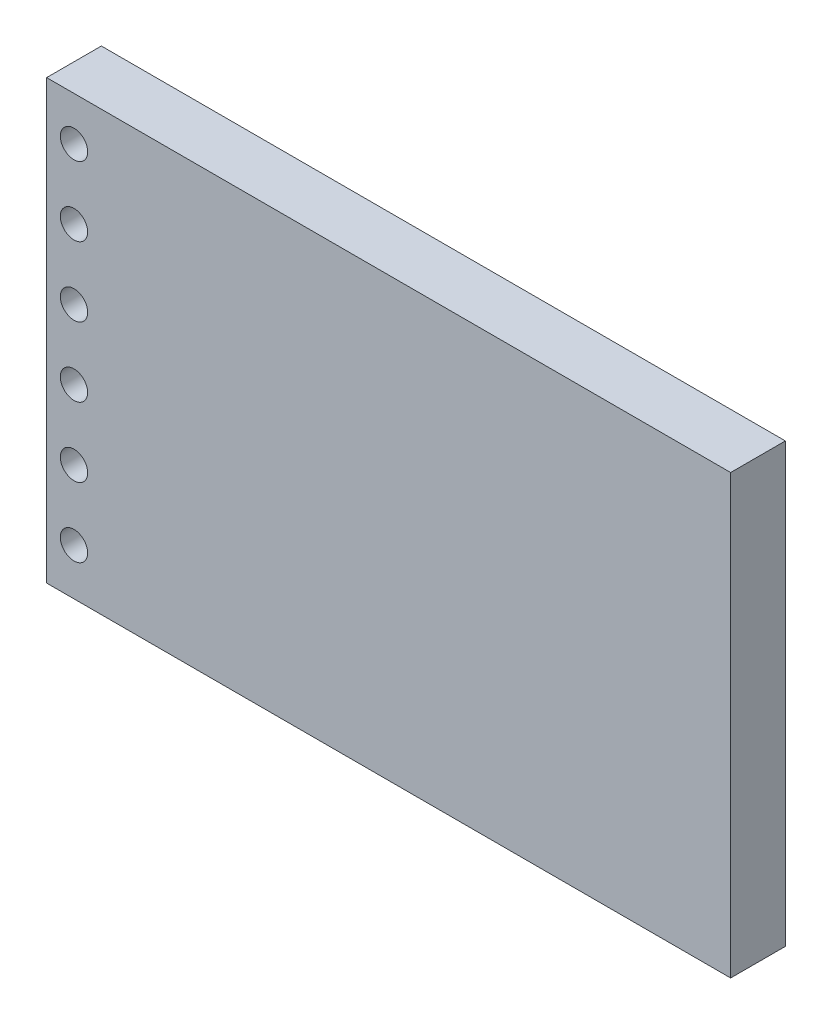
ISO-10303-21;
HEADER;
FILE_DESCRIPTION(('STEP AP214'),'2;1');
FILE_NAME('part.step','',(''),(''),'','','');
FILE_SCHEMA(('AUTOMOTIVE_DESIGN { 1 0 10303 214 1 1 1 1 }'));
ENDSEC;
DATA;
#1=APPLICATION_CONTEXT('core data for automotive mechanical design processes');
#2=APPLICATION_PROTOCOL_DEFINITION('international standard','automotive_design',2000,#1);
#3=PRODUCT_CONTEXT('',#1,'mechanical');
#4=PRODUCT('Part','Part','',(#3));
#5=PRODUCT_RELATED_PRODUCT_CATEGORY('part','',(#4));
#6=PRODUCT_DEFINITION_FORMATION('','',#4);
#7=PRODUCT_DEFINITION_CONTEXT('part definition',#1,'design');
#8=PRODUCT_DEFINITION('design','',#6,#7);
#9=PRODUCT_DEFINITION_SHAPE('','',#8);
#10=(LENGTH_UNIT() NAMED_UNIT(*) SI_UNIT(.MILLI.,.METRE.));
#11=(NAMED_UNIT(*) PLANE_ANGLE_UNIT() SI_UNIT($,.RADIAN.));
#12=(NAMED_UNIT(*) SI_UNIT($,.STERADIAN.) SOLID_ANGLE_UNIT());
#13=UNCERTAINTY_MEASURE_WITH_UNIT(LENGTH_MEASURE(1.E-05),#10,'distance_accuracy_value','');
#14=(GEOMETRIC_REPRESENTATION_CONTEXT(3) GLOBAL_UNCERTAINTY_ASSIGNED_CONTEXT((#13)) GLOBAL_UNIT_ASSIGNED_CONTEXT((#10,
#11,#12)) REPRESENTATION_CONTEXT('',''));
#15=CARTESIAN_POINT('',(0.,0.,0.));
#16=DIRECTION('',(0.,0.,1.));
#17=DIRECTION('',(1.,0.,0.));
#18=AXIS2_PLACEMENT_3D('',#15,#16,#17);
#19=CARTESIAN_POINT('',(0.,0.,2.));
#20=DIRECTION('',(0.,1.,0.));
#21=DIRECTION('',(0.,0.,1.));
#22=AXIS2_PLACEMENT_3D('',#19,#20,#21);
#23=PLANE('',#22);
#24=DIRECTION('',(1.,0.,0.));
#25=VECTOR('',#24,1.);
#26=CARTESIAN_POINT('',(0.,0.,0.));
#27=LINE('',#26,#25);
#28=CARTESIAN_POINT('',(0.,0.,0.));
#29=VERTEX_POINT('',#28);
#30=CARTESIAN_POINT('',(18.,0.,0.));
#31=VERTEX_POINT('',#30);
#32=EDGE_CURVE('E446',#29,#31,#27,.T.);
#33=ORIENTED_EDGE('',*,*,#32,.T.);
#34=DIRECTION('',(0.,0.,1.));
#35=VECTOR('',#34,1.);
#36=CARTESIAN_POINT('',(18.,0.,-2.));
#37=LINE('',#36,#35);
#38=CARTESIAN_POINT('',(18.,0.,-2.));
#39=VERTEX_POINT('',#38);
#40=EDGE_CURVE('E274',#39,#31,#37,.T.);
#41=ORIENTED_EDGE('',*,*,#40,.F.);
#42=DIRECTION('',(-1.,0.,0.));
#43=VECTOR('',#42,1.);
#44=CARTESIAN_POINT('',(22.,0.,-2.));
#45=LINE('',#44,#43);
#46=CARTESIAN_POINT('',(22.,0.,-2.));
#47=VERTEX_POINT('',#46);
#48=EDGE_CURVE('E259',#47,#39,#45,.T.);
#49=ORIENTED_EDGE('',*,*,#48,.F.);
#50=DIRECTION('',(0.,0.,1.));
#51=VECTOR('',#50,1.);
#52=CARTESIAN_POINT('',(22.,0.,-2.));
#53=LINE('',#52,#51);
#54=CARTESIAN_POINT('',(22.,0.,0.));
#55=VERTEX_POINT('',#54);
#56=EDGE_CURVE('E276',#47,#55,#53,.T.);
#57=ORIENTED_EDGE('',*,*,#56,.T.);
#58=CARTESIAN_POINT('',(25.,0.,0.));
#59=VERTEX_POINT('',#58);
#60=EDGE_CURVE('E445',#55,#59,#27,.T.);
#61=ORIENTED_EDGE('',*,*,#60,.T.);
#62=DIRECTION('',(0.,0.,-1.));
#63=VECTOR('',#62,1.);
#64=CARTESIAN_POINT('',(25.,0.,2.));
#65=LINE('',#64,#63);
#66=CARTESIAN_POINT('',(25.,0.,2.));
#67=VERTEX_POINT('',#66);
#68=EDGE_CURVE('E50',#67,#59,#65,.T.);
#69=ORIENTED_EDGE('',*,*,#68,.F.);
#70=DIRECTION('',(1.,0.,0.));
#71=VECTOR('',#70,1.);
#72=CARTESIAN_POINT('',(0.,0.,2.));
#73=LINE('',#72,#71);
#74=CARTESIAN_POINT('',(0.,0.,2.));
#75=VERTEX_POINT('',#74);
#76=EDGE_CURVE('E435',#75,#67,#73,.T.);
#77=ORIENTED_EDGE('',*,*,#76,.F.);
#78=DIRECTION('',(0.,0.,-1.));
#79=VECTOR('',#78,1.);
#80=CARTESIAN_POINT('',(0.,0.,2.));
#81=LINE('',#80,#79);
#82=EDGE_CURVE('E11',#75,#29,#81,.T.);
#83=ORIENTED_EDGE('',*,*,#82,.T.);
#84=EDGE_LOOP('',(#33,#41,#49,#57,#61,#69,#77,#83));
#85=FACE_BOUND('',#84,.T.);
#86=DIRECTION('',(0.,0.,-1.));
#87=VECTOR('',#86,1.);
#88=CARTESIAN_POINT('',(19.114135809883,0.,-0.309527281272606));
#89=LINE('',#88,#87);
#90=CARTESIAN_POINT('',(19.114135809883,0.,-0.309527281272606));
#91=VERTEX_POINT('',#90);
#92=CARTESIAN_POINT('',(19.114135809883,0.,-1.36845032168736));
#93=VERTEX_POINT('',#92);
#94=EDGE_CURVE('E247',#91,#93,#89,.T.);
#95=ORIENTED_EDGE('',*,*,#94,.F.);
#96=DIRECTION('',(-1.,0.,0.));
#97=VECTOR('',#96,1.);
#98=CARTESIAN_POINT('',(19.114135809883,0.,-0.309527281272606));
#99=LINE('',#98,#97);
#100=CARTESIAN_POINT('',(20.8827625901502,0.,-0.309527281272606));
#101=VERTEX_POINT('',#100);
#102=EDGE_CURVE('E244',#101,#91,#99,.T.);
#103=ORIENTED_EDGE('',*,*,#102,.F.);
#104=DIRECTION('',(0.,0.,1.));
#105=VECTOR('',#104,1.);
#106=CARTESIAN_POINT('',(20.8827625901502,0.,-0.309527281272606));
#107=LINE('',#106,#105);
#108=CARTESIAN_POINT('',(20.8827625901502,0.,-1.36845032168736));
#109=VERTEX_POINT('',#108);
#110=EDGE_CURVE('E62',#109,#101,#107,.T.);
#111=ORIENTED_EDGE('',*,*,#110,.F.);
#112=DIRECTION('',(1.,0.,0.));
#113=VECTOR('',#112,1.);
#114=CARTESIAN_POINT('',(19.114135809883,0.,-1.36845032168736));
#115=LINE('',#114,#113);
#116=EDGE_CURVE('E57',#93,#109,#115,.T.);
#117=ORIENTED_EDGE('',*,*,#116,.F.);
#118=EDGE_LOOP('',(#95,#103,#111,#117));
#119=FACE_BOUND('',#118,.T.);
#120=ADVANCED_FACE('F42',(#85,#119),#23,.F.);
#121=CARTESIAN_POINT('',(0.,0.,0.));
#122=DIRECTION('',(0.,0.,-1.));
#123=DIRECTION('',(-1.,0.,0.));
#124=AXIS2_PLACEMENT_3D('',#121,#122,#123);
#125=PLANE('',#124);
#126=CARTESIAN_POINT('',(1.,14.4,0.));
#127=DIRECTION('',(0.,0.,-1.));
#128=DIRECTION('',(-1.,0.,0.));
#129=AXIS2_PLACEMENT_3D('',#126,#127,#128);
#130=CIRCLE('',#129,0.500000000000001);
#131=CARTESIAN_POINT('',(0.499999999999999,14.4,0.));
#132=VERTEX_POINT('',#131);
#133=EDGE_CURVE('E400',#132,#132,#130,.T.);
#134=ORIENTED_EDGE('',*,*,#133,.F.);
#135=EDGE_LOOP('',(#134));
#136=FACE_BOUND('',#135,.T.);
#137=CARTESIAN_POINT('',(0.999999999999974,11.86,0.));
#138=DIRECTION('',(0.,0.,-1.));
#139=DIRECTION('',(-1.,0.,0.));
#140=AXIS2_PLACEMENT_3D('',#137,#138,#139);
#141=CIRCLE('',#140,0.500000000000001);
#142=CARTESIAN_POINT('',(0.499999999999973,11.86,0.));
#143=VERTEX_POINT('',#142);
#144=EDGE_CURVE('E403',#143,#143,#141,.T.);
#145=ORIENTED_EDGE('',*,*,#144,.F.);
#146=EDGE_LOOP('',(#145));
#147=FACE_BOUND('',#146,.T.);
#148=CARTESIAN_POINT('',(0.999999999999947,9.32,0.));
#149=DIRECTION('',(0.,0.,-1.));
#150=DIRECTION('',(-1.,0.,0.));
#151=AXIS2_PLACEMENT_3D('',#148,#149,#150);
#152=CIRCLE('',#151,0.500000000000001);
#153=CARTESIAN_POINT('',(0.499999999999947,9.32,0.));
#154=VERTEX_POINT('',#153);
#155=EDGE_CURVE('E409',#154,#154,#152,.T.);
#156=ORIENTED_EDGE('',*,*,#155,.F.);
#157=EDGE_LOOP('',(#156));
#158=FACE_BOUND('',#157,.T.);
#159=CARTESIAN_POINT('',(0.999999999999921,6.78,0.));
#160=DIRECTION('',(0.,0.,-1.));
#161=DIRECTION('',(-1.,0.,0.));
#162=AXIS2_PLACEMENT_3D('',#159,#160,#161);
#163=CIRCLE('',#162,0.500000000000001);
#164=CARTESIAN_POINT('',(0.49999999999992,6.78,0.));
#165=VERTEX_POINT('',#164);
#166=EDGE_CURVE('E415',#165,#165,#163,.T.);
#167=ORIENTED_EDGE('',*,*,#166,.F.);
#168=EDGE_LOOP('',(#167));
#169=FACE_BOUND('',#168,.T.);
#170=CARTESIAN_POINT('',(0.999999999999894,4.24,0.));
#171=DIRECTION('',(0.,0.,-1.));
#172=DIRECTION('',(-1.,0.,0.));
#173=AXIS2_PLACEMENT_3D('',#170,#171,#172);
#174=CIRCLE('',#173,0.500000000000001);
#175=CARTESIAN_POINT('',(0.499999999999894,4.24,0.));
#176=VERTEX_POINT('',#175);
#177=EDGE_CURVE('E421',#176,#176,#174,.T.);
#178=ORIENTED_EDGE('',*,*,#177,.F.);
#179=EDGE_LOOP('',(#178));
#180=FACE_BOUND('',#179,.T.);
#181=CARTESIAN_POINT('',(0.999999999999868,1.7,0.));
#182=DIRECTION('',(0.,0.,-1.));
#183=DIRECTION('',(-1.,0.,0.));
#184=AXIS2_PLACEMENT_3D('',#181,#182,#183);
#185=CIRCLE('',#184,0.5);
#186=CARTESIAN_POINT('',(0.499999999999867,1.7,0.));
#187=VERTEX_POINT('',#186);
#188=EDGE_CURVE('E427',#187,#187,#185,.T.);
#189=ORIENTED_EDGE('',*,*,#188,.F.);
#190=EDGE_LOOP('',(#189));
#191=FACE_BOUND('',#190,.T.);
#192=DIRECTION('',(-1.,0.,0.));
#193=VECTOR('',#192,1.);
#194=CARTESIAN_POINT('',(23.7997794032277,9.5,0.));
#195=LINE('',#194,#193);
#196=CARTESIAN_POINT('',(23.7997794032277,9.5,0.));
#197=VERTEX_POINT('',#196);
#198=CARTESIAN_POINT('',(21.8013468013468,9.5,0.));
#199=VERTEX_POINT('',#198);
#200=EDGE_CURVE('E380',#197,#199,#195,.T.);
#201=ORIENTED_EDGE('',*,*,#200,.F.);
#202=DIRECTION('',(0.,-1.,0.));
#203=VECTOR('',#202,1.);
#204=CARTESIAN_POINT('',(23.7997794032277,10.5,0.));
#205=LINE('',#204,#203);
#206=CARTESIAN_POINT('',(23.7997794032277,10.5,0.));
#207=VERTEX_POINT('',#206);
#208=EDGE_CURVE('E359',#207,#197,#205,.T.);
#209=ORIENTED_EDGE('',*,*,#208,.F.);
#210=DIRECTION('',(1.,0.,0.));
#211=VECTOR('',#210,1.);
#212=CARTESIAN_POINT('',(23.7997794032277,10.5,0.));
#213=LINE('',#212,#211);
#214=CARTESIAN_POINT('',(21.8013468013468,10.5,0.));
#215=VERTEX_POINT('',#214);
#216=EDGE_CURVE('E371',#215,#207,#213,.T.);
#217=ORIENTED_EDGE('',*,*,#216,.F.);
#218=DIRECTION('',(0.,1.,0.));
#219=VECTOR('',#218,1.);
#220=CARTESIAN_POINT('',(21.8013468013468,10.5,0.));
#221=LINE('',#220,#219);
#222=EDGE_CURVE('E382',#199,#215,#221,.T.);
#223=ORIENTED_EDGE('',*,*,#222,.F.);
#224=EDGE_LOOP('',(#201,#209,#217,#223));
#225=FACE_BOUND('',#224,.T.);
#226=DIRECTION('',(-1.,0.,0.));
#227=VECTOR('',#226,1.);
#228=CARTESIAN_POINT('',(23.7997794032277,7.5,0.));
#229=LINE('',#228,#227);
#230=CARTESIAN_POINT('',(23.7997794032277,7.5,0.));
#231=VERTEX_POINT('',#230);
#232=CARTESIAN_POINT('',(21.8013468013468,7.5,0.));
#233=VERTEX_POINT('',#232);
#234=EDGE_CURVE('E354',#231,#233,#229,.T.);
#235=ORIENTED_EDGE('',*,*,#234,.F.);
#236=DIRECTION('',(0.,-1.,0.));
#237=VECTOR('',#236,1.);
#238=CARTESIAN_POINT('',(23.7997794032277,8.5,0.));
#239=LINE('',#238,#237);
#240=CARTESIAN_POINT('',(23.7997794032277,8.5,0.));
#241=VERTEX_POINT('',#240);
#242=EDGE_CURVE('E356',#241,#231,#239,.T.);
#243=ORIENTED_EDGE('',*,*,#242,.F.);
#244=DIRECTION('',(1.,0.,0.));
#245=VECTOR('',#244,1.);
#246=CARTESIAN_POINT('',(23.7997794032277,8.5,0.));
#247=LINE('',#246,#245);
#248=CARTESIAN_POINT('',(21.8013468013468,8.5,0.));
#249=VERTEX_POINT('',#248);
#250=EDGE_CURVE('E348',#249,#241,#247,.T.);
#251=ORIENTED_EDGE('',*,*,#250,.F.);
#252=DIRECTION('',(0.,1.,0.));
#253=VECTOR('',#252,1.);
#254=CARTESIAN_POINT('',(21.8013468013468,8.5,0.));
#255=LINE('',#254,#253);
#256=EDGE_CURVE('E350',#233,#249,#255,.T.);
#257=ORIENTED_EDGE('',*,*,#256,.F.);
#258=EDGE_LOOP('',(#235,#243,#251,#257));
#259=FACE_BOUND('',#258,.T.);
#260=DIRECTION('',(-1.,0.,0.));
#261=VECTOR('',#260,1.);
#262=CARTESIAN_POINT('',(23.7997794032276,5.5,0.));
#263=LINE('',#262,#261);
#264=CARTESIAN_POINT('',(23.7997794032276,5.5,0.));
#265=VERTEX_POINT('',#264);
#266=CARTESIAN_POINT('',(21.8013468013468,5.5,0.));
#267=VERTEX_POINT('',#266);
#268=EDGE_CURVE('E325',#265,#267,#263,.T.);
#269=ORIENTED_EDGE('',*,*,#268,.F.);
#270=DIRECTION('',(0.,-1.,0.));
#271=VECTOR('',#270,1.);
#272=CARTESIAN_POINT('',(23.7997794032276,6.5,0.));
#273=LINE('',#272,#271);
#274=CARTESIAN_POINT('',(23.7997794032276,6.5,0.));
#275=VERTEX_POINT('',#274);
#276=EDGE_CURVE('E327',#275,#265,#273,.T.);
#277=ORIENTED_EDGE('',*,*,#276,.F.);
#278=DIRECTION('',(1.,0.,0.));
#279=VECTOR('',#278,1.);
#280=CARTESIAN_POINT('',(23.7997794032276,6.5,0.));
#281=LINE('',#280,#279);
#282=CARTESIAN_POINT('',(21.8013468013468,6.5,0.));
#283=VERTEX_POINT('',#282);
#284=EDGE_CURVE('E319',#283,#275,#281,.T.);
#285=ORIENTED_EDGE('',*,*,#284,.F.);
#286=DIRECTION('',(0.,1.,0.));
#287=VECTOR('',#286,1.);
#288=CARTESIAN_POINT('',(21.8013468013468,6.5,0.));
#289=LINE('',#288,#287);
#290=EDGE_CURVE('E321',#267,#283,#289,.T.);
#291=ORIENTED_EDGE('',*,*,#290,.F.);
#292=EDGE_LOOP('',(#269,#277,#285,#291));
#293=FACE_BOUND('',#292,.T.);
#294=DIRECTION('',(-1.,0.,0.));
#295=VECTOR('',#294,1.);
#296=CARTESIAN_POINT('',(23.7997794032276,3.5,0.));
#297=LINE('',#296,#295);
#298=CARTESIAN_POINT('',(23.7997794032276,3.5,0.));
#299=VERTEX_POINT('',#298);
#300=CARTESIAN_POINT('',(21.8013468013467,3.5,0.));
#301=VERTEX_POINT('',#300);
#302=EDGE_CURVE('E296',#299,#301,#297,.T.);
#303=ORIENTED_EDGE('',*,*,#302,.F.);
#304=DIRECTION('',(0.,-1.,0.));
#305=VECTOR('',#304,1.);
#306=CARTESIAN_POINT('',(23.7997794032276,4.5,0.));
#307=LINE('',#306,#305);
#308=CARTESIAN_POINT('',(23.7997794032276,4.5,0.));
#309=VERTEX_POINT('',#308);
#310=EDGE_CURVE('E298',#309,#299,#307,.T.);
#311=ORIENTED_EDGE('',*,*,#310,.F.);
#312=DIRECTION('',(1.,0.,0.));
#313=VECTOR('',#312,1.);
#314=CARTESIAN_POINT('',(23.7997794032276,4.5,0.));
#315=LINE('',#314,#313);
#316=CARTESIAN_POINT('',(21.8013468013467,4.5,0.));
#317=VERTEX_POINT('',#316);
#318=EDGE_CURVE('E290',#317,#309,#315,.T.);
#319=ORIENTED_EDGE('',*,*,#318,.F.);
#320=DIRECTION('',(0.,1.,0.));
#321=VECTOR('',#320,1.);
#322=CARTESIAN_POINT('',(21.8013468013467,4.5,0.));
#323=LINE('',#322,#321);
#324=EDGE_CURVE('E292',#301,#317,#323,.T.);
#325=ORIENTED_EDGE('',*,*,#324,.F.);
#326=EDGE_LOOP('',(#303,#311,#319,#325));
#327=FACE_BOUND('',#326,.T.);
#328=ORIENTED_EDGE('',*,*,#60,.F.);
#329=DIRECTION('',(0.,-1.,0.));
#330=VECTOR('',#329,1.);
#331=CARTESIAN_POINT('',(22.,0.,0.));
#332=LINE('',#331,#330);
#333=CARTESIAN_POINT('',(22.,2.,0.));
#334=VERTEX_POINT('',#333);
#335=EDGE_CURVE('E248',#334,#55,#332,.T.);
#336=ORIENTED_EDGE('',*,*,#335,.F.);
#337=DIRECTION('',(1.,0.,0.));
#338=VECTOR('',#337,1.);
#339=CARTESIAN_POINT('',(22.,2.,0.));
#340=LINE('',#339,#338);
#341=CARTESIAN_POINT('',(18.,2.,0.));
#342=VERTEX_POINT('',#341);
#343=EDGE_CURVE('E260',#342,#334,#340,.T.);
#344=ORIENTED_EDGE('',*,*,#343,.F.);
#345=DIRECTION('',(0.,1.,0.));
#346=VECTOR('',#345,1.);
#347=CARTESIAN_POINT('',(18.,0.,0.));
#348=LINE('',#347,#346);
#349=EDGE_CURVE('E250',#31,#342,#348,.T.);
#350=ORIENTED_EDGE('',*,*,#349,.F.);
#351=ORIENTED_EDGE('',*,*,#32,.F.);
#352=DIRECTION('',(0.,-1.,0.));
#353=VECTOR('',#352,1.);
#354=CARTESIAN_POINT('',(0.,0.,0.));
#355=LINE('',#354,#353);
#356=CARTESIAN_POINT('',(0.,16.,0.));
#357=VERTEX_POINT('',#356);
#358=EDGE_CURVE('E399',#357,#29,#355,.T.);
#359=ORIENTED_EDGE('',*,*,#358,.F.);
#360=DIRECTION('',(-1.,0.,0.));
#361=VECTOR('',#360,1.);
#362=CARTESIAN_POINT('',(0.,16.,0.));
#363=LINE('',#362,#361);
#364=CARTESIAN_POINT('',(25.,16.,0.));
#365=VERTEX_POINT('',#364);
#366=EDGE_CURVE('E436',#365,#357,#363,.T.);
#367=ORIENTED_EDGE('',*,*,#366,.F.);
#368=DIRECTION('',(0.,1.,0.));
#369=VECTOR('',#368,1.);
#370=CARTESIAN_POINT('',(25.,0.,0.));
#371=LINE('',#370,#369);
#372=EDGE_CURVE('E449',#59,#365,#371,.T.);
#373=ORIENTED_EDGE('',*,*,#372,.F.);
#374=EDGE_LOOP('',(#328,#336,#344,#350,#351,#359,#367,#373));
#375=FACE_BOUND('',#374,.T.);
#376=ADVANCED_FACE('F467',(#136,#147,#158,#169,#180,#191,#225,#259,#293,#327,#375),#125,.T.);
#377=CARTESIAN_POINT('',(0.,0.,2.));
#378=DIRECTION('',(1.,0.,0.));
#379=DIRECTION('',(0.,0.,-1.));
#380=AXIS2_PLACEMENT_3D('',#377,#378,#379);
#381=PLANE('',#380);
#382=ORIENTED_EDGE('',*,*,#358,.T.);
#383=ORIENTED_EDGE('',*,*,#82,.F.);
#384=DIRECTION('',(0.,-1.,0.));
#385=VECTOR('',#384,1.);
#386=CARTESIAN_POINT('',(0.,0.,2.));
#387=LINE('',#386,#385);
#388=CARTESIAN_POINT('',(0.,16.,2.));
#389=VERTEX_POINT('',#388);
#390=EDGE_CURVE('E432',#389,#75,#387,.T.);
#391=ORIENTED_EDGE('',*,*,#390,.F.);
#392=DIRECTION('',(0.,0.,-1.));
#393=VECTOR('',#392,1.);
#394=CARTESIAN_POINT('',(0.,16.,2.));
#395=LINE('',#394,#393);
#396=EDGE_CURVE('E442',#389,#357,#395,.T.);
#397=ORIENTED_EDGE('',*,*,#396,.T.);
#398=EDGE_LOOP('',(#382,#383,#391,#397));
#399=FACE_BOUND('',#398,.T.);
#400=ADVANCED_FACE('F44',(#399),#381,.F.);
#401=CARTESIAN_POINT('',(25.,0.,2.));
#402=DIRECTION('',(-1.,0.,0.));
#403=DIRECTION('',(0.,0.,1.));
#404=AXIS2_PLACEMENT_3D('',#401,#402,#403);
#405=PLANE('',#404);
#406=ORIENTED_EDGE('',*,*,#372,.T.);
#407=DIRECTION('',(0.,0.,-1.));
#408=VECTOR('',#407,1.);
#409=CARTESIAN_POINT('',(25.,16.,2.));
#410=LINE('',#409,#408);
#411=CARTESIAN_POINT('',(25.,16.,2.));
#412=VERTEX_POINT('',#411);
#413=EDGE_CURVE('E454',#412,#365,#410,.T.);
#414=ORIENTED_EDGE('',*,*,#413,.F.);
#415=DIRECTION('',(0.,1.,0.));
#416=VECTOR('',#415,1.);
#417=CARTESIAN_POINT('',(25.,0.,2.));
#418=LINE('',#417,#416);
#419=EDGE_CURVE('E438',#67,#412,#418,.T.);
#420=ORIENTED_EDGE('',*,*,#419,.F.);
#421=ORIENTED_EDGE('',*,*,#68,.T.);
#422=EDGE_LOOP('',(#406,#414,#420,#421));
#423=FACE_BOUND('',#422,.T.);
#424=ADVANCED_FACE('F461',(#423),#405,.F.);
#425=CARTESIAN_POINT('',(0.,16.,2.));
#426=DIRECTION('',(0.,-1.,0.));
#427=DIRECTION('',(0.,0.,-1.));
#428=AXIS2_PLACEMENT_3D('',#425,#426,#427);
#429=PLANE('',#428);
#430=ORIENTED_EDGE('',*,*,#366,.T.);
#431=ORIENTED_EDGE('',*,*,#396,.F.);
#432=DIRECTION('',(-1.,0.,0.));
#433=VECTOR('',#432,1.);
#434=CARTESIAN_POINT('',(0.,16.,2.));
#435=LINE('',#434,#433);
#436=EDGE_CURVE('E440',#412,#389,#435,.T.);
#437=ORIENTED_EDGE('',*,*,#436,.F.);
#438=ORIENTED_EDGE('',*,*,#413,.T.);
#439=EDGE_LOOP('',(#430,#431,#437,#438));
#440=FACE_BOUND('',#439,.T.);
#441=ADVANCED_FACE('F472',(#440),#429,.F.);
#442=CARTESIAN_POINT('',(0.,0.,2.));
#443=DIRECTION('',(0.,0.,-1.));
#444=DIRECTION('',(-1.,0.,0.));
#445=AXIS2_PLACEMENT_3D('',#442,#443,#444);
#446=PLANE('',#445);
#447=CARTESIAN_POINT('',(1.,14.4,2.));
#448=DIRECTION('',(0.,0.,-1.));
#449=DIRECTION('',(-1.,0.,0.));
#450=AXIS2_PLACEMENT_3D('',#447,#448,#449);
#451=CIRCLE('',#450,0.500000000000001);
#452=CARTESIAN_POINT('',(0.499999999999999,14.4,2.));
#453=VERTEX_POINT('',#452);
#454=EDGE_CURVE('E396',#453,#453,#451,.T.);
#455=ORIENTED_EDGE('',*,*,#454,.T.);
#456=EDGE_LOOP('',(#455));
#457=FACE_BOUND('',#456,.T.);
#458=CARTESIAN_POINT('',(0.999999999999974,11.86,2.));
#459=DIRECTION('',(0.,0.,-1.));
#460=DIRECTION('',(-1.,0.,0.));
#461=AXIS2_PLACEMENT_3D('',#458,#459,#460);
#462=CIRCLE('',#461,0.500000000000001);
#463=CARTESIAN_POINT('',(0.499999999999973,11.86,2.));
#464=VERTEX_POINT('',#463);
#465=EDGE_CURVE('E406',#464,#464,#462,.T.);
#466=ORIENTED_EDGE('',*,*,#465,.T.);
#467=EDGE_LOOP('',(#466));
#468=FACE_BOUND('',#467,.T.);
#469=CARTESIAN_POINT('',(0.999999999999947,9.32,2.));
#470=DIRECTION('',(0.,0.,-1.));
#471=DIRECTION('',(-1.,0.,0.));
#472=AXIS2_PLACEMENT_3D('',#469,#470,#471);
#473=CIRCLE('',#472,0.500000000000001);
#474=CARTESIAN_POINT('',(0.499999999999947,9.32,2.));
#475=VERTEX_POINT('',#474);
#476=EDGE_CURVE('E412',#475,#475,#473,.T.);
#477=ORIENTED_EDGE('',*,*,#476,.T.);
#478=EDGE_LOOP('',(#477));
#479=FACE_BOUND('',#478,.T.);
#480=CARTESIAN_POINT('',(0.999999999999921,6.78,2.));
#481=DIRECTION('',(0.,0.,-1.));
#482=DIRECTION('',(-1.,0.,0.));
#483=AXIS2_PLACEMENT_3D('',#480,#481,#482);
#484=CIRCLE('',#483,0.500000000000001);
#485=CARTESIAN_POINT('',(0.49999999999992,6.78,2.));
#486=VERTEX_POINT('',#485);
#487=EDGE_CURVE('E418',#486,#486,#484,.T.);
#488=ORIENTED_EDGE('',*,*,#487,.T.);
#489=EDGE_LOOP('',(#488));
#490=FACE_BOUND('',#489,.T.);
#491=CARTESIAN_POINT('',(0.999999999999894,4.24,2.));
#492=DIRECTION('',(0.,0.,-1.));
#493=DIRECTION('',(-1.,0.,0.));
#494=AXIS2_PLACEMENT_3D('',#491,#492,#493);
#495=CIRCLE('',#494,0.500000000000001);
#496=CARTESIAN_POINT('',(0.499999999999894,4.24,2.));
#497=VERTEX_POINT('',#496);
#498=EDGE_CURVE('E424',#497,#497,#495,.T.);
#499=ORIENTED_EDGE('',*,*,#498,.T.);
#500=EDGE_LOOP('',(#499));
#501=FACE_BOUND('',#500,.T.);
#502=CARTESIAN_POINT('',(0.999999999999868,1.7,2.));
#503=DIRECTION('',(0.,0.,-1.));
#504=DIRECTION('',(-1.,0.,0.));
#505=AXIS2_PLACEMENT_3D('',#502,#503,#504);
#506=CIRCLE('',#505,0.5);
#507=CARTESIAN_POINT('',(0.499999999999867,1.7,2.));
#508=VERTEX_POINT('',#507);
#509=EDGE_CURVE('E395',#508,#508,#506,.T.);
#510=ORIENTED_EDGE('',*,*,#509,.T.);
#511=EDGE_LOOP('',(#510));
#512=FACE_BOUND('',#511,.T.);
#513=ORIENTED_EDGE('',*,*,#390,.T.);
#514=ORIENTED_EDGE('',*,*,#76,.T.);
#515=ORIENTED_EDGE('',*,*,#419,.T.);
#516=ORIENTED_EDGE('',*,*,#436,.T.);
#517=EDGE_LOOP('',(#513,#514,#515,#516));
#518=FACE_BOUND('',#517,.T.);
#519=ADVANCED_FACE('F478',(#457,#468,#479,#490,#501,#512,#518),#446,.F.);
#520=CARTESIAN_POINT('',(0.999999999999868,1.7,2.));
#521=DIRECTION('',(0.,0.,-1.));
#522=DIRECTION('',(-1.,0.,0.));
#523=AXIS2_PLACEMENT_3D('',#520,#521,#522);
#524=CYLINDRICAL_SURFACE('',#523,0.5);
#525=ORIENTED_EDGE('',*,*,#509,.F.);
#526=EDGE_LOOP('',(#525));
#527=FACE_BOUND('',#526,.T.);
#528=ORIENTED_EDGE('',*,*,#188,.T.);
#529=EDGE_LOOP('',(#528));
#530=FACE_BOUND('',#529,.T.);
#531=ADVANCED_FACE('F522',(#527,#530),#524,.F.);
#532=CARTESIAN_POINT('',(0.999999999999894,4.24,2.));
#533=DIRECTION('',(0.,0.,-1.));
#534=DIRECTION('',(-1.,0.,0.));
#535=AXIS2_PLACEMENT_3D('',#532,#533,#534);
#536=CYLINDRICAL_SURFACE('',#535,0.500000000000001);
#537=ORIENTED_EDGE('',*,*,#498,.F.);
#538=EDGE_LOOP('',(#537));
#539=FACE_BOUND('',#538,.T.);
#540=ORIENTED_EDGE('',*,*,#177,.T.);
#541=EDGE_LOOP('',(#540));
#542=FACE_BOUND('',#541,.T.);
#543=ADVANCED_FACE('F526',(#539,#542),#536,.F.);
#544=CARTESIAN_POINT('',(0.999999999999921,6.78,2.));
#545=DIRECTION('',(0.,0.,-1.));
#546=DIRECTION('',(-1.,0.,0.));
#547=AXIS2_PLACEMENT_3D('',#544,#545,#546);
#548=CYLINDRICAL_SURFACE('',#547,0.500000000000001);
#549=ORIENTED_EDGE('',*,*,#487,.F.);
#550=EDGE_LOOP('',(#549));
#551=FACE_BOUND('',#550,.T.);
#552=ORIENTED_EDGE('',*,*,#166,.T.);
#553=EDGE_LOOP('',(#552));
#554=FACE_BOUND('',#553,.T.);
#555=ADVANCED_FACE('F530',(#551,#554),#548,.F.);
#556=CARTESIAN_POINT('',(0.999999999999947,9.32,2.));
#557=DIRECTION('',(0.,0.,-1.));
#558=DIRECTION('',(-1.,0.,0.));
#559=AXIS2_PLACEMENT_3D('',#556,#557,#558);
#560=CYLINDRICAL_SURFACE('',#559,0.500000000000001);
#561=ORIENTED_EDGE('',*,*,#476,.F.);
#562=EDGE_LOOP('',(#561));
#563=FACE_BOUND('',#562,.T.);
#564=ORIENTED_EDGE('',*,*,#155,.T.);
#565=EDGE_LOOP('',(#564));
#566=FACE_BOUND('',#565,.T.);
#567=ADVANCED_FACE('F534',(#563,#566),#560,.F.);
#568=CARTESIAN_POINT('',(0.999999999999974,11.86,2.));
#569=DIRECTION('',(0.,0.,-1.));
#570=DIRECTION('',(-1.,0.,0.));
#571=AXIS2_PLACEMENT_3D('',#568,#569,#570);
#572=CYLINDRICAL_SURFACE('',#571,0.500000000000001);
#573=ORIENTED_EDGE('',*,*,#465,.F.);
#574=EDGE_LOOP('',(#573));
#575=FACE_BOUND('',#574,.T.);
#576=ORIENTED_EDGE('',*,*,#144,.T.);
#577=EDGE_LOOP('',(#576));
#578=FACE_BOUND('',#577,.T.);
#579=ADVANCED_FACE('F538',(#575,#578),#572,.F.);
#580=CARTESIAN_POINT('',(1.,14.4,2.));
#581=DIRECTION('',(0.,0.,-1.));
#582=DIRECTION('',(-1.,0.,0.));
#583=AXIS2_PLACEMENT_3D('',#580,#581,#582);
#584=CYLINDRICAL_SURFACE('',#583,0.500000000000001);
#585=ORIENTED_EDGE('',*,*,#454,.F.);
#586=EDGE_LOOP('',(#585));
#587=FACE_BOUND('',#586,.T.);
#588=ORIENTED_EDGE('',*,*,#133,.T.);
#589=EDGE_LOOP('',(#588));
#590=FACE_BOUND('',#589,.T.);
#591=ADVANCED_FACE('F542',(#587,#590),#584,.F.);
#592=CARTESIAN_POINT('',(23.7997794032277,10.5,-0.5));
#593=DIRECTION('',(-1.,0.,0.));
#594=DIRECTION('',(0.,0.,1.));
#595=AXIS2_PLACEMENT_3D('',#592,#593,#594);
#596=PLANE('',#595);
#597=ORIENTED_EDGE('',*,*,#208,.T.);
#598=DIRECTION('',(0.,0.,1.));
#599=VECTOR('',#598,1.);
#600=CARTESIAN_POINT('',(23.7997794032277,9.5,-0.5));
#601=LINE('',#600,#599);
#602=CARTESIAN_POINT('',(23.7997794032277,9.5,-0.5));
#603=VERTEX_POINT('',#602);
#604=EDGE_CURVE('E393',#603,#197,#601,.T.);
#605=ORIENTED_EDGE('',*,*,#604,.F.);
#606=DIRECTION('',(0.,-1.,0.));
#607=VECTOR('',#606,1.);
#608=CARTESIAN_POINT('',(23.7997794032277,10.5,-0.5));
#609=LINE('',#608,#607);
#610=CARTESIAN_POINT('',(23.7997794032277,10.5,-0.5));
#611=VERTEX_POINT('',#610);
#612=EDGE_CURVE('E367',#611,#603,#609,.T.);
#613=ORIENTED_EDGE('',*,*,#612,.F.);
#614=DIRECTION('',(0.,0.,1.));
#615=VECTOR('',#614,1.);
#616=CARTESIAN_POINT('',(23.7997794032277,10.5,-0.5));
#617=LINE('',#616,#615);
#618=EDGE_CURVE('E377',#611,#207,#617,.T.);
#619=ORIENTED_EDGE('',*,*,#618,.T.);
#620=EDGE_LOOP('',(#597,#605,#613,#619));
#621=FACE_BOUND('',#620,.T.);
#622=ADVANCED_FACE('F546',(#621),#596,.F.);
#623=CARTESIAN_POINT('',(23.7997794032277,9.5,-0.5));
#624=DIRECTION('',(0.,1.,0.));
#625=DIRECTION('',(0.,0.,1.));
#626=AXIS2_PLACEMENT_3D('',#623,#624,#625);
#627=PLANE('',#626);
#628=ORIENTED_EDGE('',*,*,#200,.T.);
#629=DIRECTION('',(0.,0.,1.));
#630=VECTOR('',#629,1.);
#631=CARTESIAN_POINT('',(21.8013468013468,9.5,-0.5));
#632=LINE('',#631,#630);
#633=CARTESIAN_POINT('',(21.8013468013468,9.5,-0.5));
#634=VERTEX_POINT('',#633);
#635=EDGE_CURVE('E390',#634,#199,#632,.T.);
#636=ORIENTED_EDGE('',*,*,#635,.F.);
#637=DIRECTION('',(-1.,0.,0.));
#638=VECTOR('',#637,1.);
#639=CARTESIAN_POINT('',(23.7997794032277,9.5,-0.5));
#640=LINE('',#639,#638);
#641=EDGE_CURVE('E370',#603,#634,#640,.T.);
#642=ORIENTED_EDGE('',*,*,#641,.F.);
#643=ORIENTED_EDGE('',*,*,#604,.T.);
#644=EDGE_LOOP('',(#628,#636,#642,#643));
#645=FACE_BOUND('',#644,.T.);
#646=ADVANCED_FACE('F550',(#645),#627,.F.);
#647=CARTESIAN_POINT('',(21.8013468013468,10.5,-0.5));
#648=DIRECTION('',(1.,0.,0.));
#649=DIRECTION('',(0.,0.,-1.));
#650=AXIS2_PLACEMENT_3D('',#647,#648,#649);
#651=PLANE('',#650);
#652=ORIENTED_EDGE('',*,*,#222,.T.);
#653=DIRECTION('',(0.,0.,1.));
#654=VECTOR('',#653,1.);
#655=CARTESIAN_POINT('',(21.8013468013468,10.5,-0.5));
#656=LINE('',#655,#654);
#657=CARTESIAN_POINT('',(21.8013468013468,10.5,-0.5));
#658=VERTEX_POINT('',#657);
#659=EDGE_CURVE('E388',#658,#215,#656,.T.);
#660=ORIENTED_EDGE('',*,*,#659,.F.);
#661=DIRECTION('',(0.,1.,0.));
#662=VECTOR('',#661,1.);
#663=CARTESIAN_POINT('',(21.8013468013468,10.5,-0.5));
#664=LINE('',#663,#662);
#665=EDGE_CURVE('E373',#634,#658,#664,.T.);
#666=ORIENTED_EDGE('',*,*,#665,.F.);
#667=ORIENTED_EDGE('',*,*,#635,.T.);
#668=EDGE_LOOP('',(#652,#660,#666,#667));
#669=FACE_BOUND('',#668,.T.);
#670=ADVANCED_FACE('F554',(#669),#651,.F.);
#671=CARTESIAN_POINT('',(23.7997794032277,10.5,-0.5));
#672=DIRECTION('',(0.,-1.,0.));
#673=DIRECTION('',(1.,0.,0.));
#674=AXIS2_PLACEMENT_3D('',#671,#672,#673);
#675=PLANE('',#674);
#676=ORIENTED_EDGE('',*,*,#216,.T.);
#677=ORIENTED_EDGE('',*,*,#618,.F.);
#678=DIRECTION('',(1.,0.,0.));
#679=VECTOR('',#678,1.);
#680=CARTESIAN_POINT('',(23.7997794032277,10.5,-0.5));
#681=LINE('',#680,#679);
#682=EDGE_CURVE('E375',#658,#611,#681,.T.);
#683=ORIENTED_EDGE('',*,*,#682,.F.);
#684=ORIENTED_EDGE('',*,*,#659,.T.);
#685=EDGE_LOOP('',(#676,#677,#683,#684));
#686=FACE_BOUND('',#685,.T.);
#687=ADVANCED_FACE('F558',(#686),#675,.F.);
#688=CARTESIAN_POINT('',(0.,0.,-0.5));
#689=DIRECTION('',(0.,0.,-1.));
#690=DIRECTION('',(-1.,0.,0.));
#691=AXIS2_PLACEMENT_3D('',#688,#689,#690);
#692=PLANE('',#691);
#693=ORIENTED_EDGE('',*,*,#612,.T.);
#694=ORIENTED_EDGE('',*,*,#641,.T.);
#695=ORIENTED_EDGE('',*,*,#665,.T.);
#696=ORIENTED_EDGE('',*,*,#682,.T.);
#697=EDGE_LOOP('',(#693,#694,#695,#696));
#698=FACE_BOUND('',#697,.T.);
#699=ADVANCED_FACE('F562',(#698),#692,.T.);
#700=CARTESIAN_POINT('',(23.7997794032277,8.5,-0.5));
#701=DIRECTION('',(-1.,0.,0.));
#702=DIRECTION('',(0.,0.,1.));
#703=AXIS2_PLACEMENT_3D('',#700,#701,#702);
#704=PLANE('',#703);
#705=ORIENTED_EDGE('',*,*,#242,.T.);
#706=DIRECTION('',(0.,0.,1.));
#707=VECTOR('',#706,1.);
#708=CARTESIAN_POINT('',(23.7997794032277,7.5,-0.5));
#709=LINE('',#708,#707);
#710=CARTESIAN_POINT('',(23.7997794032277,7.5,-0.5));
#711=VERTEX_POINT('',#710);
#712=EDGE_CURVE('E330',#711,#231,#709,.T.);
#713=ORIENTED_EDGE('',*,*,#712,.F.);
#714=DIRECTION('',(0.,-1.,0.));
#715=VECTOR('',#714,1.);
#716=CARTESIAN_POINT('',(23.7997794032277,8.5,-0.5));
#717=LINE('',#716,#715);
#718=CARTESIAN_POINT('',(23.7997794032277,8.5,-0.5));
#719=VERTEX_POINT('',#718);
#720=EDGE_CURVE('E351',#719,#711,#717,.T.);
#721=ORIENTED_EDGE('',*,*,#720,.F.);
#722=DIRECTION('',(0.,0.,1.));
#723=VECTOR('',#722,1.);
#724=CARTESIAN_POINT('',(23.7997794032277,8.5,-0.5));
#725=LINE('',#724,#723);
#726=EDGE_CURVE('E344',#719,#241,#725,.T.);
#727=ORIENTED_EDGE('',*,*,#726,.T.);
#728=EDGE_LOOP('',(#705,#713,#721,#727));
#729=FACE_BOUND('',#728,.T.);
#730=ADVANCED_FACE('F566',(#729),#704,.F.);
#731=CARTESIAN_POINT('',(23.7997794032277,7.5,-0.5));
#732=DIRECTION('',(0.,1.,0.));
#733=DIRECTION('',(0.,0.,1.));
#734=AXIS2_PLACEMENT_3D('',#731,#732,#733);
#735=PLANE('',#734);
#736=ORIENTED_EDGE('',*,*,#234,.T.);
#737=DIRECTION('',(0.,0.,1.));
#738=VECTOR('',#737,1.);
#739=CARTESIAN_POINT('',(21.8013468013468,7.5,-0.5));
#740=LINE('',#739,#738);
#741=CARTESIAN_POINT('',(21.8013468013468,7.5,-0.5));
#742=VERTEX_POINT('',#741);
#743=EDGE_CURVE('E339',#742,#233,#740,.T.);
#744=ORIENTED_EDGE('',*,*,#743,.F.);
#745=DIRECTION('',(-1.,0.,0.));
#746=VECTOR('',#745,1.);
#747=CARTESIAN_POINT('',(23.7997794032277,7.5,-0.5));
#748=LINE('',#747,#746);
#749=EDGE_CURVE('E363',#711,#742,#748,.T.);
#750=ORIENTED_EDGE('',*,*,#749,.F.);
#751=ORIENTED_EDGE('',*,*,#712,.T.);
#752=EDGE_LOOP('',(#736,#744,#750,#751));
#753=FACE_BOUND('',#752,.T.);
#754=ADVANCED_FACE('F580',(#753),#735,.F.);
#755=CARTESIAN_POINT('',(21.8013468013468,8.5,-0.5));
#756=DIRECTION('',(1.,0.,0.));
#757=DIRECTION('',(0.,0.,-1.));
#758=AXIS2_PLACEMENT_3D('',#755,#756,#757);
#759=PLANE('',#758);
#760=ORIENTED_EDGE('',*,*,#256,.T.);
#761=DIRECTION('',(0.,0.,1.));
#762=VECTOR('',#761,1.);
#763=CARTESIAN_POINT('',(21.8013468013468,8.5,-0.5));
#764=LINE('',#763,#762);
#765=CARTESIAN_POINT('',(21.8013468013468,8.5,-0.5));
#766=VERTEX_POINT('',#765);
#767=EDGE_CURVE('E342',#766,#249,#764,.T.);
#768=ORIENTED_EDGE('',*,*,#767,.F.);
#769=DIRECTION('',(0.,1.,0.));
#770=VECTOR('',#769,1.);
#771=CARTESIAN_POINT('',(21.8013468013468,8.5,-0.5));
#772=LINE('',#771,#770);
#773=EDGE_CURVE('E361',#742,#766,#772,.T.);
#774=ORIENTED_EDGE('',*,*,#773,.F.);
#775=ORIENTED_EDGE('',*,*,#743,.T.);
#776=EDGE_LOOP('',(#760,#768,#774,#775));
#777=FACE_BOUND('',#776,.T.);
#778=ADVANCED_FACE('F576',(#777),#759,.F.);
#779=CARTESIAN_POINT('',(23.7997794032277,8.5,-0.5));
#780=DIRECTION('',(0.,-1.,0.));
#781=DIRECTION('',(1.,0.,0.));
#782=AXIS2_PLACEMENT_3D('',#779,#780,#781);
#783=PLANE('',#782);
#784=ORIENTED_EDGE('',*,*,#250,.T.);
#785=ORIENTED_EDGE('',*,*,#726,.F.);
#786=DIRECTION('',(1.,0.,0.));
#787=VECTOR('',#786,1.);
#788=CARTESIAN_POINT('',(23.7997794032277,8.5,-0.5));
#789=LINE('',#788,#787);
#790=EDGE_CURVE('E347',#766,#719,#789,.T.);
#791=ORIENTED_EDGE('',*,*,#790,.F.);
#792=ORIENTED_EDGE('',*,*,#767,.T.);
#793=EDGE_LOOP('',(#784,#785,#791,#792));
#794=FACE_BOUND('',#793,.T.);
#795=ADVANCED_FACE('F572',(#794),#783,.F.);
#796=CARTESIAN_POINT('',(0.,0.,-0.5));
#797=DIRECTION('',(0.,0.,-1.));
#798=DIRECTION('',(-1.,0.,0.));
#799=AXIS2_PLACEMENT_3D('',#796,#797,#798);
#800=PLANE('',#799);
#801=ORIENTED_EDGE('',*,*,#720,.T.);
#802=ORIENTED_EDGE('',*,*,#749,.T.);
#803=ORIENTED_EDGE('',*,*,#773,.T.);
#804=ORIENTED_EDGE('',*,*,#790,.T.);
#805=EDGE_LOOP('',(#801,#802,#803,#804));
#806=FACE_BOUND('',#805,.T.);
#807=ADVANCED_FACE('F568',(#806),#800,.T.);
#808=CARTESIAN_POINT('',(23.7997794032276,6.5,-0.5));
#809=DIRECTION('',(-1.,0.,0.));
#810=DIRECTION('',(0.,0.,1.));
#811=AXIS2_PLACEMENT_3D('',#808,#809,#810);
#812=PLANE('',#811);
#813=ORIENTED_EDGE('',*,*,#276,.T.);
#814=DIRECTION('',(0.,0.,1.));
#815=VECTOR('',#814,1.);
#816=CARTESIAN_POINT('',(23.7997794032276,5.5,-0.5));
#817=LINE('',#816,#815);
#818=CARTESIAN_POINT('',(23.7997794032276,5.5,-0.5));
#819=VERTEX_POINT('',#818);
#820=EDGE_CURVE('E301',#819,#265,#817,.T.);
#821=ORIENTED_EDGE('',*,*,#820,.F.);
#822=DIRECTION('',(0.,-1.,0.));
#823=VECTOR('',#822,1.);
#824=CARTESIAN_POINT('',(23.7997794032276,6.5,-0.5));
#825=LINE('',#824,#823);
#826=CARTESIAN_POINT('',(23.7997794032276,6.5,-0.5));
#827=VERTEX_POINT('',#826);
#828=EDGE_CURVE('E322',#827,#819,#825,.T.);
#829=ORIENTED_EDGE('',*,*,#828,.F.);
#830=DIRECTION('',(0.,0.,1.));
#831=VECTOR('',#830,1.);
#832=CARTESIAN_POINT('',(23.7997794032276,6.5,-0.5));
#833=LINE('',#832,#831);
#834=EDGE_CURVE('E315',#827,#275,#833,.T.);
#835=ORIENTED_EDGE('',*,*,#834,.T.);
#836=EDGE_LOOP('',(#813,#821,#829,#835));
#837=FACE_BOUND('',#836,.T.);
#838=ADVANCED_FACE('F571',(#837),#812,.F.);
#839=CARTESIAN_POINT('',(23.7997794032276,5.5,-0.5));
#840=DIRECTION('',(0.,1.,0.));
#841=DIRECTION('',(0.,0.,1.));
#842=AXIS2_PLACEMENT_3D('',#839,#840,#841);
#843=PLANE('',#842);
#844=ORIENTED_EDGE('',*,*,#268,.T.);
#845=DIRECTION('',(0.,0.,1.));
#846=VECTOR('',#845,1.);
#847=CARTESIAN_POINT('',(21.8013468013468,5.5,-0.5));
#848=LINE('',#847,#846);
#849=CARTESIAN_POINT('',(21.8013468013468,5.5,-0.5));
#850=VERTEX_POINT('',#849);
#851=EDGE_CURVE('E310',#850,#267,#848,.T.);
#852=ORIENTED_EDGE('',*,*,#851,.F.);
#853=DIRECTION('',(-1.,0.,0.));
#854=VECTOR('',#853,1.);
#855=CARTESIAN_POINT('',(23.7997794032276,5.5,-0.5));
#856=LINE('',#855,#854);
#857=EDGE_CURVE('E334',#819,#850,#856,.T.);
#858=ORIENTED_EDGE('',*,*,#857,.F.);
#859=ORIENTED_EDGE('',*,*,#820,.T.);
#860=EDGE_LOOP('',(#844,#852,#858,#859));
#861=FACE_BOUND('',#860,.T.);
#862=ADVANCED_FACE('F600',(#861),#843,.F.);
#863=CARTESIAN_POINT('',(21.8013468013468,6.5,-0.5));
#864=DIRECTION('',(1.,0.,0.));
#865=DIRECTION('',(0.,0.,-1.));
#866=AXIS2_PLACEMENT_3D('',#863,#864,#865);
#867=PLANE('',#866);
#868=ORIENTED_EDGE('',*,*,#290,.T.);
#869=DIRECTION('',(0.,0.,1.));
#870=VECTOR('',#869,1.);
#871=CARTESIAN_POINT('',(21.8013468013468,6.5,-0.5));
#872=LINE('',#871,#870);
#873=CARTESIAN_POINT('',(21.8013468013468,6.5,-0.5));
#874=VERTEX_POINT('',#873);
#875=EDGE_CURVE('E313',#874,#283,#872,.T.);
#876=ORIENTED_EDGE('',*,*,#875,.F.);
#877=DIRECTION('',(0.,1.,0.));
#878=VECTOR('',#877,1.);
#879=CARTESIAN_POINT('',(21.8013468013468,6.5,-0.5));
#880=LINE('',#879,#878);
#881=EDGE_CURVE('E332',#850,#874,#880,.T.);
#882=ORIENTED_EDGE('',*,*,#881,.F.);
#883=ORIENTED_EDGE('',*,*,#851,.T.);
#884=EDGE_LOOP('',(#868,#876,#882,#883));
#885=FACE_BOUND('',#884,.T.);
#886=ADVANCED_FACE('F596',(#885),#867,.F.);
#887=CARTESIAN_POINT('',(23.7997794032276,6.5,-0.5));
#888=DIRECTION('',(0.,-1.,0.));
#889=DIRECTION('',(1.,0.,0.));
#890=AXIS2_PLACEMENT_3D('',#887,#888,#889);
#891=PLANE('',#890);
#892=ORIENTED_EDGE('',*,*,#284,.T.);
#893=ORIENTED_EDGE('',*,*,#834,.F.);
#894=DIRECTION('',(1.,0.,0.));
#895=VECTOR('',#894,1.);
#896=CARTESIAN_POINT('',(23.7997794032276,6.5,-0.5));
#897=LINE('',#896,#895);
#898=EDGE_CURVE('E318',#874,#827,#897,.T.);
#899=ORIENTED_EDGE('',*,*,#898,.F.);
#900=ORIENTED_EDGE('',*,*,#875,.T.);
#901=EDGE_LOOP('',(#892,#893,#899,#900));
#902=FACE_BOUND('',#901,.T.);
#903=ADVANCED_FACE('F592',(#902),#891,.F.);
#904=CARTESIAN_POINT('',(0.,0.,-0.5));
#905=DIRECTION('',(0.,0.,-1.));
#906=DIRECTION('',(-1.,0.,0.));
#907=AXIS2_PLACEMENT_3D('',#904,#905,#906);
#908=PLANE('',#907);
#909=ORIENTED_EDGE('',*,*,#828,.T.);
#910=ORIENTED_EDGE('',*,*,#857,.T.);
#911=ORIENTED_EDGE('',*,*,#881,.T.);
#912=ORIENTED_EDGE('',*,*,#898,.T.);
#913=EDGE_LOOP('',(#909,#910,#911,#912));
#914=FACE_BOUND('',#913,.T.);
#915=ADVANCED_FACE('F588',(#914),#908,.T.);
#916=CARTESIAN_POINT('',(23.7997794032276,4.5,-0.5));
#917=DIRECTION('',(-1.,0.,0.));
#918=DIRECTION('',(0.,0.,1.));
#919=AXIS2_PLACEMENT_3D('',#916,#917,#918);
#920=PLANE('',#919);
#921=ORIENTED_EDGE('',*,*,#310,.T.);
#922=DIRECTION('',(0.,0.,1.));
#923=VECTOR('',#922,1.);
#924=CARTESIAN_POINT('',(23.7997794032276,3.5,-0.5));
#925=LINE('',#924,#923);
#926=CARTESIAN_POINT('',(23.7997794032276,3.5,-0.5));
#927=VERTEX_POINT('',#926);
#928=EDGE_CURVE('E279',#927,#299,#925,.T.);
#929=ORIENTED_EDGE('',*,*,#928,.F.);
#930=DIRECTION('',(0.,-1.,0.));
#931=VECTOR('',#930,1.);
#932=CARTESIAN_POINT('',(23.7997794032276,4.5,-0.5));
#933=LINE('',#932,#931);
#934=CARTESIAN_POINT('',(23.7997794032276,4.5,-0.5));
#935=VERTEX_POINT('',#934);
#936=EDGE_CURVE('E293',#935,#927,#933,.T.);
#937=ORIENTED_EDGE('',*,*,#936,.F.);
#938=DIRECTION('',(0.,0.,1.));
#939=VECTOR('',#938,1.);
#940=CARTESIAN_POINT('',(23.7997794032276,4.5,-0.5));
#941=LINE('',#940,#939);
#942=EDGE_CURVE('E286',#935,#309,#941,.T.);
#943=ORIENTED_EDGE('',*,*,#942,.T.);
#944=EDGE_LOOP('',(#921,#929,#937,#943));
#945=FACE_BOUND('',#944,.T.);
#946=ADVANCED_FACE('F591',(#945),#920,.F.);
#947=CARTESIAN_POINT('',(23.7997794032276,3.5,-0.5));
#948=DIRECTION('',(0.,1.,0.));
#949=DIRECTION('',(0.,0.,1.));
#950=AXIS2_PLACEMENT_3D('',#947,#948,#949);
#951=PLANE('',#950);
#952=ORIENTED_EDGE('',*,*,#302,.T.);
#953=DIRECTION('',(0.,0.,1.));
#954=VECTOR('',#953,1.);
#955=CARTESIAN_POINT('',(21.8013468013467,3.5,-0.5));
#956=LINE('',#955,#954);
#957=CARTESIAN_POINT('',(21.8013468013467,3.5,-0.5));
#958=VERTEX_POINT('',#957);
#959=EDGE_CURVE('E281',#958,#301,#956,.T.);
#960=ORIENTED_EDGE('',*,*,#959,.F.);
#961=DIRECTION('',(-1.,0.,0.));
#962=VECTOR('',#961,1.);
#963=CARTESIAN_POINT('',(23.7997794032276,3.5,-0.5));
#964=LINE('',#963,#962);
#965=EDGE_CURVE('E305',#927,#958,#964,.T.);
#966=ORIENTED_EDGE('',*,*,#965,.F.);
#967=ORIENTED_EDGE('',*,*,#928,.T.);
#968=EDGE_LOOP('',(#952,#960,#966,#967));
#969=FACE_BOUND('',#968,.T.);
#970=ADVANCED_FACE('F614',(#969),#951,.F.);
#971=CARTESIAN_POINT('',(21.8013468013467,4.5,-0.5));
#972=DIRECTION('',(1.,0.,0.));
#973=DIRECTION('',(0.,0.,-1.));
#974=AXIS2_PLACEMENT_3D('',#971,#972,#973);
#975=PLANE('',#974);
#976=ORIENTED_EDGE('',*,*,#324,.T.);
#977=DIRECTION('',(0.,0.,1.));
#978=VECTOR('',#977,1.);
#979=CARTESIAN_POINT('',(21.8013468013467,4.5,-0.5));
#980=LINE('',#979,#978);
#981=CARTESIAN_POINT('',(21.8013468013467,4.5,-0.5));
#982=VERTEX_POINT('',#981);
#983=EDGE_CURVE('E284',#982,#317,#980,.T.);
#984=ORIENTED_EDGE('',*,*,#983,.F.);
#985=DIRECTION('',(0.,1.,0.));
#986=VECTOR('',#985,1.);
#987=CARTESIAN_POINT('',(21.8013468013467,4.5,-0.5));
#988=LINE('',#987,#986);
#989=EDGE_CURVE('E303',#958,#982,#988,.T.);
#990=ORIENTED_EDGE('',*,*,#989,.F.);
#991=ORIENTED_EDGE('',*,*,#959,.T.);
#992=EDGE_LOOP('',(#976,#984,#990,#991));
#993=FACE_BOUND('',#992,.T.);
#994=ADVANCED_FACE('F610',(#993),#975,.F.);
#995=CARTESIAN_POINT('',(23.7997794032276,4.5,-0.5));
#996=DIRECTION('',(0.,-1.,0.));
#997=DIRECTION('',(1.,0.,0.));
#998=AXIS2_PLACEMENT_3D('',#995,#996,#997);
#999=PLANE('',#998);
#1000=ORIENTED_EDGE('',*,*,#318,.T.);
#1001=ORIENTED_EDGE('',*,*,#942,.F.);
#1002=DIRECTION('',(1.,0.,0.));
#1003=VECTOR('',#1002,1.);
#1004=CARTESIAN_POINT('',(23.7997794032276,4.5,-0.5));
#1005=LINE('',#1004,#1003);
#1006=EDGE_CURVE('E289',#982,#935,#1005,.T.);
#1007=ORIENTED_EDGE('',*,*,#1006,.F.);
#1008=ORIENTED_EDGE('',*,*,#983,.T.);
#1009=EDGE_LOOP('',(#1000,#1001,#1007,#1008));
#1010=FACE_BOUND('',#1009,.T.);
#1011=ADVANCED_FACE('F505',(#1010),#999,.F.);
#1012=CARTESIAN_POINT('',(0.,0.,-0.5));
#1013=DIRECTION('',(0.,0.,-1.));
#1014=DIRECTION('',(-1.,0.,0.));
#1015=AXIS2_PLACEMENT_3D('',#1012,#1013,#1014);
#1016=PLANE('',#1015);
#1017=ORIENTED_EDGE('',*,*,#936,.T.);
#1018=ORIENTED_EDGE('',*,*,#965,.T.);
#1019=ORIENTED_EDGE('',*,*,#989,.T.);
#1020=ORIENTED_EDGE('',*,*,#1006,.T.);
#1021=EDGE_LOOP('',(#1017,#1018,#1019,#1020));
#1022=FACE_BOUND('',#1021,.T.);
#1023=ADVANCED_FACE('F497',(#1022),#1016,.T.);
#1024=CARTESIAN_POINT('',(22.,0.,-2.));
#1025=DIRECTION('',(-1.,0.,0.));
#1026=DIRECTION('',(0.,0.,1.));
#1027=AXIS2_PLACEMENT_3D('',#1024,#1025,#1026);
#1028=PLANE('',#1027);
#1029=ORIENTED_EDGE('',*,*,#335,.T.);
#1030=ORIENTED_EDGE('',*,*,#56,.F.);
#1031=DIRECTION('',(0.,-1.,0.));
#1032=VECTOR('',#1031,1.);
#1033=CARTESIAN_POINT('',(22.,0.,-2.));
#1034=LINE('',#1033,#1032);
#1035=CARTESIAN_POINT('',(22.,2.,-2.));
#1036=VERTEX_POINT('',#1035);
#1037=EDGE_CURVE('E256',#1036,#47,#1034,.T.);
#1038=ORIENTED_EDGE('',*,*,#1037,.F.);
#1039=DIRECTION('',(0.,0.,1.));
#1040=VECTOR('',#1039,1.);
#1041=CARTESIAN_POINT('',(22.,2.,-2.));
#1042=LINE('',#1041,#1040);
#1043=EDGE_CURVE('E265',#1036,#334,#1042,.T.);
#1044=ORIENTED_EDGE('',*,*,#1043,.T.);
#1045=EDGE_LOOP('',(#1029,#1030,#1038,#1044));
#1046=FACE_BOUND('',#1045,.T.);
#1047=ADVANCED_FACE('F495',(#1046),#1028,.F.);
#1048=CARTESIAN_POINT('',(18.,0.,-2.));
#1049=DIRECTION('',(1.,0.,0.));
#1050=DIRECTION('',(0.,0.,-1.));
#1051=AXIS2_PLACEMENT_3D('',#1048,#1049,#1050);
#1052=PLANE('',#1051);
#1053=ORIENTED_EDGE('',*,*,#349,.T.);
#1054=DIRECTION('',(0.,0.,1.));
#1055=VECTOR('',#1054,1.);
#1056=CARTESIAN_POINT('',(18.,2.,-2.));
#1057=LINE('',#1056,#1055);
#1058=CARTESIAN_POINT('',(18.,2.,-2.));
#1059=VERTEX_POINT('',#1058);
#1060=EDGE_CURVE('E271',#1059,#342,#1057,.T.);
#1061=ORIENTED_EDGE('',*,*,#1060,.F.);
#1062=DIRECTION('',(0.,1.,0.));
#1063=VECTOR('',#1062,1.);
#1064=CARTESIAN_POINT('',(18.,0.,-2.));
#1065=LINE('',#1064,#1063);
#1066=EDGE_CURVE('E262',#39,#1059,#1065,.T.);
#1067=ORIENTED_EDGE('',*,*,#1066,.F.);
#1068=ORIENTED_EDGE('',*,*,#40,.T.);
#1069=EDGE_LOOP('',(#1053,#1061,#1067,#1068));
#1070=FACE_BOUND('',#1069,.T.);
#1071=ADVANCED_FACE('F485',(#1070),#1052,.F.);
#1072=CARTESIAN_POINT('',(22.,2.,-2.));
#1073=DIRECTION('',(0.,-1.,0.));
#1074=DIRECTION('',(0.,0.,-1.));
#1075=AXIS2_PLACEMENT_3D('',#1072,#1073,#1074);
#1076=PLANE('',#1075);
#1077=ORIENTED_EDGE('',*,*,#343,.T.);
#1078=ORIENTED_EDGE('',*,*,#1043,.F.);
#1079=DIRECTION('',(1.,0.,0.));
#1080=VECTOR('',#1079,1.);
#1081=CARTESIAN_POINT('',(22.,2.,-2.));
#1082=LINE('',#1081,#1080);
#1083=EDGE_CURVE('E264',#1059,#1036,#1082,.T.);
#1084=ORIENTED_EDGE('',*,*,#1083,.F.);
#1085=ORIENTED_EDGE('',*,*,#1060,.T.);
#1086=EDGE_LOOP('',(#1077,#1078,#1084,#1085));
#1087=FACE_BOUND('',#1086,.T.);
#1088=ADVANCED_FACE('F488',(#1087),#1076,.F.);
#1089=CARTESIAN_POINT('',(0.,0.,-2.));
#1090=DIRECTION('',(0.,0.,1.));
#1091=DIRECTION('',(1.,0.,0.));
#1092=AXIS2_PLACEMENT_3D('',#1089,#1090,#1091);
#1093=PLANE('',#1092);
#1094=ORIENTED_EDGE('',*,*,#1037,.T.);
#1095=ORIENTED_EDGE('',*,*,#48,.T.);
#1096=ORIENTED_EDGE('',*,*,#1066,.T.);
#1097=ORIENTED_EDGE('',*,*,#1083,.T.);
#1098=EDGE_LOOP('',(#1094,#1095,#1096,#1097));
#1099=FACE_BOUND('',#1098,.T.);
#1100=ADVANCED_FACE('F492',(#1099),#1093,.F.);
#1101=CARTESIAN_POINT('',(19.114135809883,-1.,-0.309527281272606));
#1102=DIRECTION('',(1.,0.,0.));
#1103=DIRECTION('',(0.,0.,-1.));
#1104=AXIS2_PLACEMENT_3D('',#1101,#1102,#1103);
#1105=PLANE('',#1104);
#1106=ORIENTED_EDGE('',*,*,#94,.T.);
#1107=DIRECTION('',(0.,1.,0.));
#1108=VECTOR('',#1107,1.);
#1109=CARTESIAN_POINT('',(19.114135809883,-1.,-1.36845032168736));
#1110=LINE('',#1109,#1108);
#1111=CARTESIAN_POINT('',(19.114135809883,-1.,-1.36845032168736));
#1112=VERTEX_POINT('',#1111);
#1113=EDGE_CURVE('E228',#1112,#93,#1110,.T.);
#1114=ORIENTED_EDGE('',*,*,#1113,.F.);
#1115=DIRECTION('',(0.,0.,-1.));
#1116=VECTOR('',#1115,1.);
#1117=CARTESIAN_POINT('',(19.114135809883,-1.,-0.309527281272606));
#1118=LINE('',#1117,#1116);
#1119=CARTESIAN_POINT('',(19.114135809883,-1.,-0.309527281272606));
#1120=VERTEX_POINT('',#1119);
#1121=EDGE_CURVE('E235',#1120,#1112,#1118,.T.);
#1122=ORIENTED_EDGE('',*,*,#1121,.F.);
#1123=DIRECTION('',(0.,1.,0.));
#1124=VECTOR('',#1123,1.);
#1125=CARTESIAN_POINT('',(19.114135809883,-1.,-0.309527281272606));
#1126=LINE('',#1125,#1124);
#1127=EDGE_CURVE('E761',#1120,#91,#1126,.T.);
#1128=ORIENTED_EDGE('',*,*,#1127,.T.);
#1129=EDGE_LOOP('',(#1106,#1114,#1122,#1128));
#1130=FACE_BOUND('',#1129,.T.);
#1131=ADVANCED_FACE('F246',(#1130),#1105,.F.);
#1132=CARTESIAN_POINT('',(19.114135809883,-1.,-1.36845032168736));
#1133=DIRECTION('',(0.,0.,1.));
#1134=DIRECTION('',(1.,0.,0.));
#1135=AXIS2_PLACEMENT_3D('',#1132,#1133,#1134);
#1136=PLANE('',#1135);
#1137=ORIENTED_EDGE('',*,*,#116,.T.);
#1138=DIRECTION('',(0.,1.,0.));
#1139=VECTOR('',#1138,1.);
#1140=CARTESIAN_POINT('',(20.8827625901502,-1.,-1.36845032168736));
#1141=LINE('',#1140,#1139);
#1142=CARTESIAN_POINT('',(20.8827625901502,-1.,-1.36845032168736));
#1143=VERTEX_POINT('',#1142);
#1144=EDGE_CURVE('E231',#1143,#109,#1141,.T.);
#1145=ORIENTED_EDGE('',*,*,#1144,.F.);
#1146=DIRECTION('',(1.,0.,0.));
#1147=VECTOR('',#1146,1.);
#1148=CARTESIAN_POINT('',(19.114135809883,-1.,-1.36845032168736));
#1149=LINE('',#1148,#1147);
#1150=EDGE_CURVE('E224',#1112,#1143,#1149,.T.);
#1151=ORIENTED_EDGE('',*,*,#1150,.F.);
#1152=ORIENTED_EDGE('',*,*,#1113,.T.);
#1153=EDGE_LOOP('',(#1137,#1145,#1151,#1152));
#1154=FACE_BOUND('',#1153,.T.);
#1155=ADVANCED_FACE('F226',(#1154),#1136,.F.);
#1156=CARTESIAN_POINT('',(20.8827625901502,-1.,-0.309527281272606));
#1157=DIRECTION('',(-1.,0.,0.));
#1158=DIRECTION('',(0.,0.,1.));
#1159=AXIS2_PLACEMENT_3D('',#1156,#1157,#1158);
#1160=PLANE('',#1159);
#1161=ORIENTED_EDGE('',*,*,#110,.T.);
#1162=DIRECTION('',(0.,1.,0.));
#1163=VECTOR('',#1162,1.);
#1164=CARTESIAN_POINT('',(20.8827625901502,-1.,-0.309527281272606));
#1165=LINE('',#1164,#1163);
#1166=CARTESIAN_POINT('',(20.8827625901502,-1.,-0.309527281272606));
#1167=VERTEX_POINT('',#1166);
#1168=EDGE_CURVE('E252',#1167,#101,#1165,.T.);
#1169=ORIENTED_EDGE('',*,*,#1168,.F.);
#1170=DIRECTION('',(0.,0.,1.));
#1171=VECTOR('',#1170,1.);
#1172=CARTESIAN_POINT('',(20.8827625901502,-1.,-0.309527281272606));
#1173=LINE('',#1172,#1171);
#1174=EDGE_CURVE('E234',#1143,#1167,#1173,.T.);
#1175=ORIENTED_EDGE('',*,*,#1174,.F.);
#1176=ORIENTED_EDGE('',*,*,#1144,.T.);
#1177=EDGE_LOOP('',(#1161,#1169,#1175,#1176));
#1178=FACE_BOUND('',#1177,.T.);
#1179=ADVANCED_FACE('F718',(#1178),#1160,.F.);
#1180=CARTESIAN_POINT('',(19.114135809883,-1.,-0.309527281272606));
#1181=DIRECTION('',(0.,0.,-1.));
#1182=DIRECTION('',(-1.,0.,0.));
#1183=AXIS2_PLACEMENT_3D('',#1180,#1181,#1182);
#1184=PLANE('',#1183);
#1185=ORIENTED_EDGE('',*,*,#102,.T.);
#1186=ORIENTED_EDGE('',*,*,#1127,.F.);
#1187=DIRECTION('',(-1.,0.,0.));
#1188=VECTOR('',#1187,1.);
#1189=CARTESIAN_POINT('',(19.114135809883,-1.,-0.309527281272606));
#1190=LINE('',#1189,#1188);
#1191=EDGE_CURVE('E240',#1167,#1120,#1190,.T.);
#1192=ORIENTED_EDGE('',*,*,#1191,.F.);
#1193=ORIENTED_EDGE('',*,*,#1168,.T.);
#1194=EDGE_LOOP('',(#1185,#1186,#1192,#1193));
#1195=FACE_BOUND('',#1194,.T.);
#1196=ADVANCED_FACE('F728',(#1195),#1184,.F.);
#1197=CARTESIAN_POINT('',(0.,-1.,0.));
#1198=DIRECTION('',(0.,-1.,0.));
#1199=DIRECTION('',(0.,0.,-1.));
#1200=AXIS2_PLACEMENT_3D('',#1197,#1198,#1199);
#1201=PLANE('',#1200);
#1202=ORIENTED_EDGE('',*,*,#1121,.T.);
#1203=ORIENTED_EDGE('',*,*,#1150,.T.);
#1204=ORIENTED_EDGE('',*,*,#1174,.T.);
#1205=ORIENTED_EDGE('',*,*,#1191,.T.);
#1206=EDGE_LOOP('',(#1202,#1203,#1204,#1205));
#1207=FACE_BOUND('',#1206,.T.);
#1208=ADVANCED_FACE('F238',(#1207),#1201,.T.);
#1209=CLOSED_SHELL('',(#120,#376,#400,#424,#441,#519,#531,#543,#555,#567,#579,#591,#622,#646,
#670,#687,#699,#730,#754,#778,#795,#807,#838,#862,#886,#903,#915,#946,#970,#994,#1011,#1023,
#1047,#1071,#1088,#1100,#1131,#1155,#1179,#1196,#1208));
#1210=MANIFOLD_SOLID_BREP('B2',#1209);
#1211=ADVANCED_BREP_SHAPE_REPRESENTATION('',(#18,#1210),#14);
#1212=SHAPE_DEFINITION_REPRESENTATION(#9,#1211);
ENDSEC;
END-ISO-10303-21;
